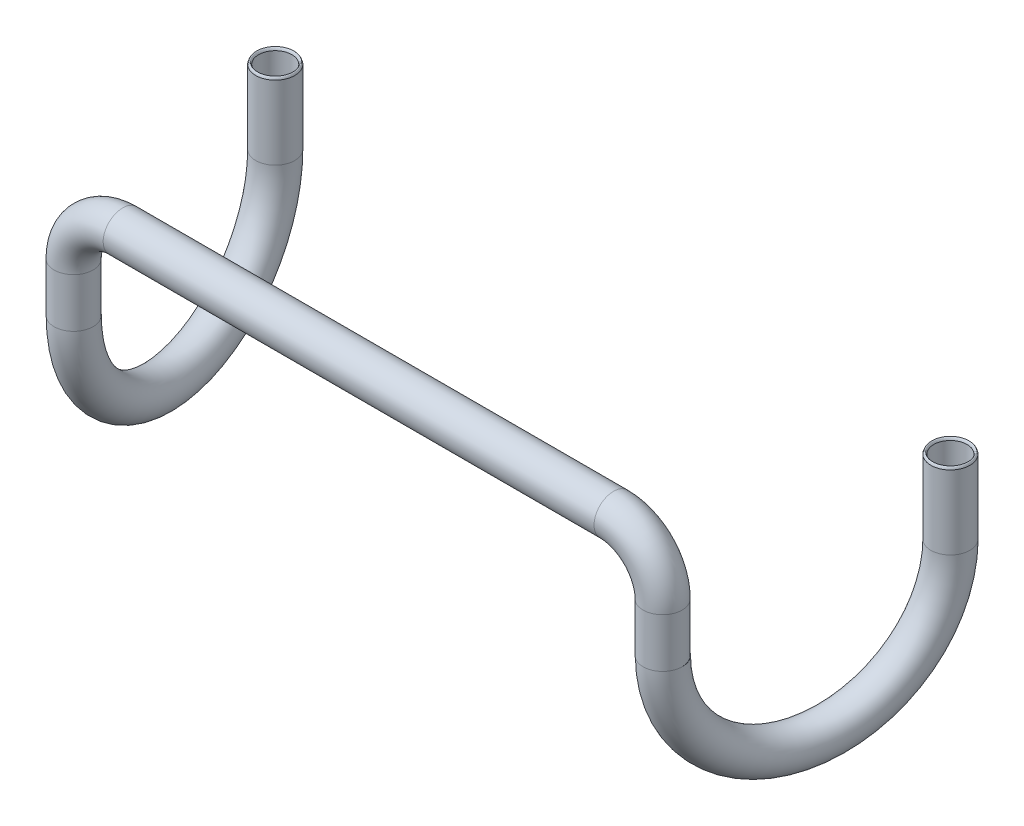
ISO-10303-21;
HEADER;
FILE_DESCRIPTION(('STEP AP214'),'2;1');
FILE_NAME('part.step','',(''),(''),'','','');
FILE_SCHEMA(('AUTOMOTIVE_DESIGN { 1 0 10303 214 1 1 1 1 }'));
ENDSEC;
DATA;
#1=APPLICATION_CONTEXT('core data for automotive mechanical design processes');
#2=APPLICATION_PROTOCOL_DEFINITION('international standard','automotive_design',2000,#1);
#3=PRODUCT_CONTEXT('',#1,'mechanical');
#4=PRODUCT('Part','Part','',(#3));
#5=PRODUCT_RELATED_PRODUCT_CATEGORY('part','',(#4));
#6=PRODUCT_DEFINITION_FORMATION('','',#4);
#7=PRODUCT_DEFINITION_CONTEXT('part definition',#1,'design');
#8=PRODUCT_DEFINITION('design','',#6,#7);
#9=PRODUCT_DEFINITION_SHAPE('','',#8);
#10=(LENGTH_UNIT() NAMED_UNIT(*) SI_UNIT(.MILLI.,.METRE.));
#11=(NAMED_UNIT(*) PLANE_ANGLE_UNIT() SI_UNIT($,.RADIAN.));
#12=(NAMED_UNIT(*) SI_UNIT($,.STERADIAN.) SOLID_ANGLE_UNIT());
#13=UNCERTAINTY_MEASURE_WITH_UNIT(LENGTH_MEASURE(1.E-05),#10,'distance_accuracy_value','');
#14=(GEOMETRIC_REPRESENTATION_CONTEXT(3) GLOBAL_UNCERTAINTY_ASSIGNED_CONTEXT((#13)) GLOBAL_UNIT_ASSIGNED_CONTEXT((#10,
#11,#12)) REPRESENTATION_CONTEXT('',''));
#15=CARTESIAN_POINT('',(0.,0.,0.));
#16=DIRECTION('',(0.,0.,1.));
#17=DIRECTION('',(1.,0.,0.));
#18=AXIS2_PLACEMENT_3D('',#15,#16,#17);
#19=CARTESIAN_POINT('',(240.,-80.,0.));
#20=DIRECTION('',(0.,-1.,0.));
#21=DIRECTION('',(0.,0.,-1.));
#22=AXIS2_PLACEMENT_3D('',#19,#20,#21);
#23=PLANE('',#22);
#24=CARTESIAN_POINT('',(240.035474595347,-79.9999999999999,-0.201612663195141));
#25=DIRECTION('',(0.,-1.,0.));
#26=DIRECTION('',(1.,0.,0.));
#27=AXIS2_PLACEMENT_3D('',#24,#25,#26);
#28=CIRCLE('',#27,13.57);
#29=CARTESIAN_POINT('',(253.388778334991,-80.,2.21379190681488));
#30=VERTEX_POINT('',#29);
#31=CARTESIAN_POINT('',(226.659698816823,-79.9999999999999,-2.48930196085725));
#32=VERTEX_POINT('',#31);
#33=EDGE_CURVE('E155',#30,#32,#28,.F.);
#34=ORIENTED_EDGE('',*,*,#33,.F.);
#35=CARTESIAN_POINT('',(240.,-80.,0.));
#36=DIRECTION('',(0.,-1.,0.));
#37=DIRECTION('',(0.,0.,-1.));
#38=AXIS2_PLACEMENT_3D('',#35,#36,#37);
#39=CIRCLE('',#38,13.5705659392009);
#40=EDGE_CURVE('E141',#30,#32,#39,.F.);
#41=ORIENTED_EDGE('',*,*,#40,.T.);
#42=EDGE_LOOP('',(#34,#41));
#43=FACE_BOUND('',#42,.T.);
#44=ADVANCED_FACE('F128',(#43),#23,.T.);
#45=CARTESIAN_POINT('',(240.035474595347,-79.9999999999999,-0.201612663195141));
#46=DIRECTION('',(0.,-1.,0.));
#47=DIRECTION('',(1.,0.,0.));
#48=AXIS2_PLACEMENT_3D('',#45,#46,#47);
#49=CIRCLE('',#48,15.9);
#50=CARTESIAN_POINT('',(255.676853348814,-80.,2.6544809435678));
#51=VERTEX_POINT('',#50);
#52=CARTESIAN_POINT('',(224.358621246532,-79.9999999999999,-2.85609360676085));
#53=VERTEX_POINT('',#52);
#54=EDGE_CURVE('E148',#51,#53,#49,.T.);
#55=ORIENTED_EDGE('',*,*,#54,.F.);
#56=CARTESIAN_POINT('',(240.,-80.,0.));
#57=DIRECTION('',(0.,-1.,0.));
#58=DIRECTION('',(0.,0.,-1.));
#59=AXIS2_PLACEMENT_3D('',#56,#57,#58);
#60=CIRCLE('',#59,15.9);
#61=EDGE_CURVE('E312',#51,#53,#60,.T.);
#62=ORIENTED_EDGE('',*,*,#61,.T.);
#63=EDGE_LOOP('',(#55,#62));
#64=FACE_BOUND('',#63,.T.);
#65=ADVANCED_FACE('F369',(#64),#23,.T.);
#66=CARTESIAN_POINT('',(0.,0.,0.));
#67=DIRECTION('',(1.,0.,0.));
#68=DIRECTION('',(0.,0.,-1.));
#69=AXIS2_PLACEMENT_3D('',#66,#67,#68);
#70=CYLINDRICAL_SURFACE('',#69,15.9);
#71=CARTESIAN_POINT('',(200.,0.,0.));
#72=DIRECTION('',(1.,0.,0.));
#73=DIRECTION('',(0.,0.,-1.));
#74=AXIS2_PLACEMENT_3D('',#71,#72,#73);
#75=CIRCLE('',#74,15.9);
#76=CARTESIAN_POINT('',(200.,15.9,0.));
#77=VERTEX_POINT('',#76);
#78=EDGE_CURVE('E317',#77,#77,#75,.T.);
#79=ORIENTED_EDGE('',*,*,#78,.F.);
#80=EDGE_LOOP('',(#79));
#81=FACE_BOUND('',#80,.T.);
#82=CARTESIAN_POINT('',(-200.,0.,0.));
#83=DIRECTION('',(1.,0.,0.));
#84=DIRECTION('',(0.,0.,-1.));
#85=AXIS2_PLACEMENT_3D('',#82,#83,#84);
#86=CIRCLE('',#85,15.9);
#87=CARTESIAN_POINT('',(-200.,15.9,0.));
#88=VERTEX_POINT('',#87);
#89=EDGE_CURVE('E217',#88,#88,#86,.T.);
#90=ORIENTED_EDGE('',*,*,#89,.T.);
#91=EDGE_LOOP('',(#90));
#92=FACE_BOUND('',#91,.T.);
#93=ADVANCED_FACE('F372',(#81,#92),#70,.T.);
#94=CARTESIAN_POINT('',(200.,-40.,0.));
#95=DIRECTION('',(0.,0.,-1.));
#96=DIRECTION('',(-1.,0.,0.));
#97=AXIS2_PLACEMENT_3D('',#94,#95,#96);
#98=TOROIDAL_SURFACE('',#97,40.,15.9);
#99=CARTESIAN_POINT('',(240.,-40.,0.));
#100=DIRECTION('',(0.,-1.,0.));
#101=DIRECTION('',(0.,0.,-1.));
#102=AXIS2_PLACEMENT_3D('',#99,#100,#101);
#103=CIRCLE('',#102,15.9);
#104=CARTESIAN_POINT('',(255.9,-40.,0.));
#105=VERTEX_POINT('',#104);
#106=EDGE_CURVE('E316',#105,#105,#103,.T.);
#107=CARTESIAN_POINT('',(200.,-40.,0.));
#108=DIRECTION('',(0.,0.,-1.));
#109=DIRECTION('',(-1.,0.,0.));
#110=AXIS2_PLACEMENT_3D('',#107,#108,#109);
#111=CIRCLE('',#110,55.9);
#112=EDGE_CURVE('',#77,#105,#111,.T.);
#113=ORIENTED_EDGE('',*,*,#78,.T.);
#114=ORIENTED_EDGE('',*,*,#106,.F.);
#115=ORIENTED_EDGE('',*,*,#112,.T.);
#116=ORIENTED_EDGE('',*,*,#112,.F.);
#117=EDGE_LOOP('',(#113,#115,#114,#116));
#118=FACE_BOUND('',#117,.T.);
#119=ADVANCED_FACE('F375',(#118),#98,.T.);
#120=CARTESIAN_POINT('',(240.,-40.,0.));
#121=DIRECTION('',(0.,-1.,0.));
#122=DIRECTION('',(1.,0.,0.));
#123=AXIS2_PLACEMENT_3D('',#120,#121,#122);
#124=CYLINDRICAL_SURFACE('',#123,15.9);
#125=ORIENTED_EDGE('',*,*,#61,.F.);
#126=EDGE_CURVE('E302',#53,#51,#60,.T.);
#127=ORIENTED_EDGE('',*,*,#126,.F.);
#128=EDGE_LOOP('',(#125,#127));
#129=FACE_BOUND('',#128,.T.);
#130=ORIENTED_EDGE('',*,*,#106,.T.);
#131=EDGE_LOOP('',(#130));
#132=FACE_BOUND('',#131,.T.);
#133=ADVANCED_FACE('F360',(#129,#132),#124,.T.);
#134=CARTESIAN_POINT('',(0.,0.,0.));
#135=DIRECTION('',(1.,0.,0.));
#136=DIRECTION('',(0.,0.,-1.));
#137=AXIS2_PLACEMENT_3D('',#134,#135,#136);
#138=CYLINDRICAL_SURFACE('',#137,13.5705659392009);
#139=CARTESIAN_POINT('',(200.,0.,0.));
#140=DIRECTION('',(1.,0.,0.));
#141=DIRECTION('',(0.,0.,-1.));
#142=AXIS2_PLACEMENT_3D('',#139,#140,#141);
#143=CIRCLE('',#142,13.5705659392009);
#144=CARTESIAN_POINT('',(200.,13.5705659392009,0.));
#145=VERTEX_POINT('',#144);
#146=EDGE_CURVE('E308',#145,#145,#143,.F.);
#147=ORIENTED_EDGE('',*,*,#146,.F.);
#148=EDGE_LOOP('',(#147));
#149=FACE_BOUND('',#148,.T.);
#150=CARTESIAN_POINT('',(-200.,0.,0.));
#151=DIRECTION('',(1.,0.,0.));
#152=DIRECTION('',(0.,0.,-1.));
#153=AXIS2_PLACEMENT_3D('',#150,#151,#152);
#154=CIRCLE('',#153,13.5705659392009);
#155=CARTESIAN_POINT('',(-200.,13.5705659392009,0.));
#156=VERTEX_POINT('',#155);
#157=EDGE_CURVE('E208',#156,#156,#154,.F.);
#158=ORIENTED_EDGE('',*,*,#157,.T.);
#159=EDGE_LOOP('',(#158));
#160=FACE_BOUND('',#159,.T.);
#161=ADVANCED_FACE('F356',(#149,#160),#138,.F.);
#162=CARTESIAN_POINT('',(200.,-40.,0.));
#163=DIRECTION('',(0.,0.,-1.));
#164=DIRECTION('',(-1.,0.,0.));
#165=AXIS2_PLACEMENT_3D('',#162,#163,#164);
#166=TOROIDAL_SURFACE('',#165,40.,13.5705659392009);
#167=CARTESIAN_POINT('',(240.,-40.,0.));
#168=DIRECTION('',(0.,-1.,0.));
#169=DIRECTION('',(0.,0.,-1.));
#170=AXIS2_PLACEMENT_3D('',#167,#168,#169);
#171=CIRCLE('',#170,13.5705659392009);
#172=CARTESIAN_POINT('',(253.570565939201,-40.,0.));
#173=VERTEX_POINT('',#172);
#174=EDGE_CURVE('E311',#173,#173,#171,.F.);
#175=CARTESIAN_POINT('',(200.,-40.,0.));
#176=DIRECTION('',(0.,0.,-1.));
#177=DIRECTION('',(-1.,0.,0.));
#178=AXIS2_PLACEMENT_3D('',#175,#176,#177);
#179=CIRCLE('',#178,53.5705659392009);
#180=EDGE_CURVE('',#145,#173,#179,.T.);
#181=ORIENTED_EDGE('',*,*,#146,.T.);
#182=ORIENTED_EDGE('',*,*,#174,.F.);
#183=ORIENTED_EDGE('',*,*,#180,.T.);
#184=ORIENTED_EDGE('',*,*,#180,.F.);
#185=EDGE_LOOP('',(#181,#183,#182,#184));
#186=FACE_BOUND('',#185,.T.);
#187=ADVANCED_FACE('F359',(#186),#166,.F.);
#188=CARTESIAN_POINT('',(240.,-40.,0.));
#189=DIRECTION('',(0.,-1.,0.));
#190=DIRECTION('',(1.,0.,0.));
#191=AXIS2_PLACEMENT_3D('',#188,#189,#190);
#192=CYLINDRICAL_SURFACE('',#191,13.5705659392009);
#193=EDGE_CURVE('E13',#32,#30,#39,.F.);
#194=ORIENTED_EDGE('',*,*,#193,.F.);
#195=ORIENTED_EDGE('',*,*,#40,.F.);
#196=EDGE_LOOP('',(#194,#195));
#197=FACE_BOUND('',#196,.T.);
#198=ORIENTED_EDGE('',*,*,#174,.T.);
#199=EDGE_LOOP('',(#198));
#200=FACE_BOUND('',#199,.T.);
#201=ADVANCED_FACE('F364',(#197,#200),#192,.F.);
#202=CARTESIAN_POINT('',(240.035474595347,-79.9999999999999,-0.201612663195141));
#203=DIRECTION('',(0.,-1.,0.));
#204=DIRECTION('',(1.,0.,0.));
#205=AXIS2_PLACEMENT_3D('',#202,#203,#204);
#206=PLANE('',#205);
#207=EDGE_CURVE('E291',#32,#30,#28,.F.);
#208=ORIENTED_EDGE('',*,*,#207,.F.);
#209=ORIENTED_EDGE('',*,*,#193,.T.);
#210=EDGE_LOOP('',(#208,#209));
#211=FACE_BOUND('',#210,.T.);
#212=ADVANCED_FACE('F348',(#211),#206,.F.);
#213=CARTESIAN_POINT('',(257.561421105602,-80.,-99.8067728164823));
#214=DIRECTION('',(0.984870472996578,0.,0.173292098548945));
#215=DIRECTION('',(0.173292098548945,0.,-0.984870472996578));
#216=AXIS2_PLACEMENT_3D('',#213,#214,#215);
#217=TOROIDAL_SURFACE('',#216,101.135289242886,15.9);
#218=CARTESIAN_POINT('',(275.087367615856,-80.0000000000001,-199.411932969769));
#219=DIRECTION('',(0.,1.,0.));
#220=DIRECTION('',(0.939939697161005,0.,0.341340542128938));
#221=AXIS2_PLACEMENT_3D('',#218,#219,#220);
#222=CIRCLE('',#221,15.9);
#223=CARTESIAN_POINT('',(290.032408800716,-80.0000000000001,-193.984618349919));
#224=VERTEX_POINT('',#223);
#225=EDGE_CURVE('E303',#224,#224,#222,.T.);
#226=ORIENTED_EDGE('',*,*,#225,.F.);
#227=EDGE_LOOP('',(#226));
#228=FACE_BOUND('',#227,.T.);
#229=ORIENTED_EDGE('',*,*,#54,.T.);
#230=EDGE_CURVE('E307',#53,#51,#49,.T.);
#231=ORIENTED_EDGE('',*,*,#230,.T.);
#232=EDGE_LOOP('',(#229,#231));
#233=FACE_BOUND('',#232,.T.);
#234=ADVANCED_FACE('F351',(#228,#233),#217,.T.);
#235=ORIENTED_EDGE('',*,*,#230,.F.);
#236=ORIENTED_EDGE('',*,*,#126,.T.);
#237=EDGE_LOOP('',(#235,#236));
#238=FACE_BOUND('',#237,.T.);
#239=ADVANCED_FACE('F346',(#238),#206,.F.);
#240=CARTESIAN_POINT('',(257.561421105602,-80.,-99.8067728164823));
#241=DIRECTION('',(0.984870472996578,0.,0.173292098548945));
#242=DIRECTION('',(0.173292098548945,0.,-0.984870472996578));
#243=AXIS2_PLACEMENT_3D('',#240,#241,#242);
#244=TOROIDAL_SURFACE('',#243,101.135289242886,13.57);
#245=CARTESIAN_POINT('',(275.087367615856,-80.0000000000001,-199.411932969769));
#246=DIRECTION('',(0.,1.,0.));
#247=DIRECTION('',(0.939939697161005,0.,0.341340542128938));
#248=AXIS2_PLACEMENT_3D('',#245,#246,#247);
#249=CIRCLE('',#248,13.57);
#250=CARTESIAN_POINT('',(287.842349306331,-80.0000000000001,-194.77994181308));
#251=VERTEX_POINT('',#250);
#252=EDGE_CURVE('E299',#251,#251,#249,.F.);
#253=ORIENTED_EDGE('',*,*,#252,.F.);
#254=EDGE_LOOP('',(#253));
#255=FACE_BOUND('',#254,.T.);
#256=ORIENTED_EDGE('',*,*,#207,.T.);
#257=ORIENTED_EDGE('',*,*,#33,.T.);
#258=EDGE_LOOP('',(#256,#257));
#259=FACE_BOUND('',#258,.T.);
#260=ADVANCED_FACE('F343',(#255,#259),#244,.F.);
#261=CARTESIAN_POINT('',(275.087367615856,-80.0000000000001,-199.411932969769));
#262=DIRECTION('',(0.,1.,0.));
#263=DIRECTION('',(0.,0.,1.));
#264=AXIS2_PLACEMENT_3D('',#261,#262,#263);
#265=CYLINDRICAL_SURFACE('',#264,15.9);
#266=CARTESIAN_POINT('',(275.087367615856,-20.,-199.411932969769));
#267=DIRECTION('',(0.,1.,0.));
#268=DIRECTION('',(-1.,0.,0.));
#269=AXIS2_PLACEMENT_3D('',#266,#267,#268);
#270=CIRCLE('',#269,15.9);
#271=CARTESIAN_POINT('',(259.187367615856,-20.,-199.411932969769));
#272=VERTEX_POINT('',#271);
#273=EDGE_CURVE('E189',#272,#272,#270,.T.);
#274=ORIENTED_EDGE('',*,*,#273,.F.);
#275=EDGE_LOOP('',(#274));
#276=FACE_BOUND('',#275,.T.);
#277=ORIENTED_EDGE('',*,*,#225,.T.);
#278=EDGE_LOOP('',(#277));
#279=FACE_BOUND('',#278,.T.);
#280=ADVANCED_FACE('F334',(#276,#279),#265,.T.);
#281=CARTESIAN_POINT('',(275.087367615856,-80.0000000000001,-199.411932969769));
#282=DIRECTION('',(0.,1.,0.));
#283=DIRECTION('',(0.,0.,1.));
#284=AXIS2_PLACEMENT_3D('',#281,#282,#283);
#285=CYLINDRICAL_SURFACE('',#284,13.57);
#286=CARTESIAN_POINT('',(275.087367615856,-20.,-199.411932969769));
#287=DIRECTION('',(0.,1.,0.));
#288=DIRECTION('',(-1.,0.,0.));
#289=AXIS2_PLACEMENT_3D('',#286,#287,#288);
#290=CIRCLE('',#289,13.57);
#291=CARTESIAN_POINT('',(261.517367615856,-20.,-199.411932969769));
#292=VERTEX_POINT('',#291);
#293=EDGE_CURVE('E322',#292,#292,#290,.F.);
#294=ORIENTED_EDGE('',*,*,#293,.F.);
#295=EDGE_LOOP('',(#294));
#296=FACE_BOUND('',#295,.T.);
#297=ORIENTED_EDGE('',*,*,#252,.T.);
#298=EDGE_LOOP('',(#297));
#299=FACE_BOUND('',#298,.T.);
#300=ADVANCED_FACE('F281',(#296,#299),#285,.F.);
#301=CARTESIAN_POINT('',(275.095647339464,-190.538331539801,-176.236169129557));
#302=CARTESIAN_POINT('',(270.45883862379,42.3046122833005,-180.872977845232));
#303=CARTESIAN_POINT('',(265.822029908117,-37.6608264869324,-185.509786560908));
#304=CARTESIAN_POINT('',(261.185221192443,-37.6609984806695,-190.146595276584));
#305=CARTESIAN_POINT('',(256.54841247677,42.3047998183723,-194.78340399226));
#306=CARTESIAN_POINT('',(251.911603761096,-190.53855846105,-199.420212707935));
#307=CARTESIAN_POINT('',(279.73649091204,42.3407917328004,-180.877012702131));
#308=CARTESIAN_POINT('',(275.099682196368,118.050039882033,-185.513821417807));
#309=CARTESIAN_POINT('',(270.462873480693,-40.4829067816589,-190.150630133483));
#310=CARTESIAN_POINT('',(265.826064765021,-40.4830357840587,-194.787438849159));
#311=CARTESIAN_POINT('',(261.189256049346,118.050111680971,-199.424247564834));
#312=CARTESIAN_POINT('',(256.552447333673,42.3409433693256,-204.06105628051));
#313=CARTESIAN_POINT('',(284.377334484618,-37.8522342839571,-185.517856274706));
#314=CARTESIAN_POINT('',(279.740525768943,-40.5859575808756,-190.154664990382));
#315=CARTESIAN_POINT('',(275.103717053272,-238.340160502466,-194.791473706058));
#316=CARTESIAN_POINT('',(270.466908337596,-238.340274995985,-199.428282421733));
#317=CARTESIAN_POINT('',(265.830099621924,-40.5860342664694,-204.065091137409));
#318=CARTESIAN_POINT('',(261.19329090625,-37.8523506278419,-208.701899853084));
#319=CARTESIAN_POINT('',(289.018178057193,-37.5986280447977,-190.15869984728));
#320=CARTESIAN_POINT('',(284.381369341522,-40.0830436532029,-194.795508562956));
#321=CARTESIAN_POINT('',(279.744560625845,-237.712605766736,-199.432317278632));
#322=CARTESIAN_POINT('',(275.107751910175,-237.712642159808,-204.069125994308));
#323=CARTESIAN_POINT('',(270.470943194499,-40.082977212654,-208.705934709983));
#324=CARTESIAN_POINT('',(265.834134478827,-37.5985338685168,-213.342743425659));
#325=CARTESIAN_POINT('',(293.659021629772,42.4780935828116,-194.799543419855));
#326=CARTESIAN_POINT('',(289.022212914096,118.934620448465,-199.436352135531));
#327=CARTESIAN_POINT('',(284.385404198425,-39.2245989975511,-204.073160851206));
#328=CARTESIAN_POINT('',(279.748595482749,-39.2245839417998,-208.709969566882));
#329=CARTESIAN_POINT('',(275.111786767078,118.934626779491,-213.346778282558));
#330=CARTESIAN_POINT('',(270.474978051403,42.4780132214629,-217.983586998234));
#331=CARTESIAN_POINT('',(298.299865202347,-192.389586436148,-199.44038699243));
#332=CARTESIAN_POINT('',(293.663056486675,41.6992773666061,-204.077195708105));
#333=CARTESIAN_POINT('',(289.026247770999,-37.6434938655722,-208.714004423781));
#334=CARTESIAN_POINT('',(284.389439055328,-37.6434561659727,-213.350813139457));
#335=CARTESIAN_POINT('',(279.752630339653,41.6992335285328,-217.987621855133));
#336=CARTESIAN_POINT('',(275.11582162398,-192.38952854488,-222.624430570808));
#337=B_SPLINE_SURFACE_WITH_KNOTS('',5,5,((#301,#302,#303,#304,#305,#306),(#307,#308,#309,#310,
#311,#312),(#313,#314,#315,#316,#317,#318),(#319,#320,#321,#322,#323,#324),(#325,#326,#327,#328,
#329,#330),(#331,#332,#333,#334,#335,#336)),.UNSPECIFIED.,.F.,.F.,.F.,(6,6),(6,6),
(-12.5986048977107,20.2171147082318),(-16.3935944193053,16.3935944398789),.UNSPECIFIED.);
#338=ORIENTED_EDGE('',*,*,#293,.T.);
#339=EDGE_LOOP('',(#338));
#340=FACE_BOUND('',#339,.T.);
#341=ORIENTED_EDGE('',*,*,#273,.T.);
#342=EDGE_LOOP('',(#341));
#343=FACE_BOUND('',#342,.T.);
#344=ADVANCED_FACE('F130',(#340,#343),#337,.T.);
#345=CARTESIAN_POINT('',(-240.,-80.,0.));
#346=DIRECTION('',(0.,-1.,0.));
#347=DIRECTION('',(0.,0.,-1.));
#348=AXIS2_PLACEMENT_3D('',#345,#346,#347);
#349=PLANE('',#348);
#350=CARTESIAN_POINT('',(-240.035474595347,-79.9999999999999,-0.201612663195141));
#351=DIRECTION('',(0.,1.,0.));
#352=DIRECTION('',(-1.,0.,0.));
#353=AXIS2_PLACEMENT_3D('',#350,#351,#352);
#354=CIRCLE('',#353,13.57);
#355=CARTESIAN_POINT('',(-253.388778334991,-80.,2.21379190681488));
#356=VERTEX_POINT('',#355);
#357=CARTESIAN_POINT('',(-226.659698816823,-79.9999999999999,-2.48930196085725));
#358=VERTEX_POINT('',#357);
#359=EDGE_CURVE('E179',#356,#358,#354,.F.);
#360=ORIENTED_EDGE('',*,*,#359,.T.);
#361=CARTESIAN_POINT('',(-240.,-80.,0.));
#362=DIRECTION('',(0.,1.,0.));
#363=DIRECTION('',(0.,0.,-1.));
#364=AXIS2_PLACEMENT_3D('',#361,#362,#363);
#365=CIRCLE('',#364,13.5705659392009);
#366=EDGE_CURVE('E190',#356,#358,#365,.F.);
#367=ORIENTED_EDGE('',*,*,#366,.F.);
#368=EDGE_LOOP('',(#360,#367));
#369=FACE_BOUND('',#368,.T.);
#370=ADVANCED_FACE('F196',(#369),#349,.T.);
#371=CARTESIAN_POINT('',(-240.035474595347,-79.9999999999999,-0.201612663195141));
#372=DIRECTION('',(0.,1.,0.));
#373=DIRECTION('',(-1.,0.,0.));
#374=AXIS2_PLACEMENT_3D('',#371,#372,#373);
#375=CIRCLE('',#374,15.9);
#376=CARTESIAN_POINT('',(-255.676853348814,-80.,2.6544809435678));
#377=VERTEX_POINT('',#376);
#378=CARTESIAN_POINT('',(-224.358621246532,-79.9999999999999,-2.85609360676085));
#379=VERTEX_POINT('',#378);
#380=EDGE_CURVE('E199',#377,#379,#375,.T.);
#381=ORIENTED_EDGE('',*,*,#380,.T.);
#382=CARTESIAN_POINT('',(-240.,-80.,0.));
#383=DIRECTION('',(0.,1.,0.));
#384=DIRECTION('',(0.,0.,-1.));
#385=AXIS2_PLACEMENT_3D('',#382,#383,#384);
#386=CIRCLE('',#385,15.9);
#387=EDGE_CURVE('E211',#377,#379,#386,.T.);
#388=ORIENTED_EDGE('',*,*,#387,.F.);
#389=EDGE_LOOP('',(#381,#388));
#390=FACE_BOUND('',#389,.T.);
#391=ADVANCED_FACE('F266',(#390),#349,.T.);
#392=CARTESIAN_POINT('',(-200.,-40.,0.));
#393=DIRECTION('',(0.,0.,-1.));
#394=DIRECTION('',(1.,0.,0.));
#395=AXIS2_PLACEMENT_3D('',#392,#393,#394);
#396=TOROIDAL_SURFACE('',#395,40.,15.9);
#397=CARTESIAN_POINT('',(-240.,-40.,0.));
#398=DIRECTION('',(0.,1.,0.));
#399=DIRECTION('',(0.,0.,-1.));
#400=AXIS2_PLACEMENT_3D('',#397,#398,#399);
#401=CIRCLE('',#400,15.9);
#402=CARTESIAN_POINT('',(-255.9,-40.,0.));
#403=VERTEX_POINT('',#402);
#404=EDGE_CURVE('E216',#403,#403,#401,.T.);
#405=CARTESIAN_POINT('',(-200.,-40.,0.));
#406=DIRECTION('',(0.,0.,-1.));
#407=DIRECTION('',(1.,0.,0.));
#408=AXIS2_PLACEMENT_3D('',#405,#406,#407);
#409=CIRCLE('',#408,55.9);
#410=EDGE_CURVE('',#403,#88,#409,.T.);
#411=ORIENTED_EDGE('',*,*,#404,.T.);
#412=ORIENTED_EDGE('',*,*,#89,.F.);
#413=ORIENTED_EDGE('',*,*,#410,.T.);
#414=ORIENTED_EDGE('',*,*,#410,.F.);
#415=EDGE_LOOP('',(#411,#413,#412,#414));
#416=FACE_BOUND('',#415,.T.);
#417=ADVANCED_FACE('F267',(#416),#396,.T.);
#418=CARTESIAN_POINT('',(-240.,-40.,0.));
#419=DIRECTION('',(0.,-1.,0.));
#420=DIRECTION('',(-1.,0.,0.));
#421=AXIS2_PLACEMENT_3D('',#418,#419,#420);
#422=CYLINDRICAL_SURFACE('',#421,15.9);
#423=ORIENTED_EDGE('',*,*,#387,.T.);
#424=EDGE_CURVE('E203',#379,#377,#386,.T.);
#425=ORIENTED_EDGE('',*,*,#424,.T.);
#426=EDGE_LOOP('',(#423,#425));
#427=FACE_BOUND('',#426,.T.);
#428=ORIENTED_EDGE('',*,*,#404,.F.);
#429=EDGE_LOOP('',(#428));
#430=FACE_BOUND('',#429,.T.);
#431=ADVANCED_FACE('F260',(#427,#430),#422,.T.);
#432=CARTESIAN_POINT('',(-200.,-40.,0.));
#433=DIRECTION('',(0.,0.,-1.));
#434=DIRECTION('',(1.,0.,0.));
#435=AXIS2_PLACEMENT_3D('',#432,#433,#434);
#436=TOROIDAL_SURFACE('',#435,40.,13.5705659392009);
#437=CARTESIAN_POINT('',(-240.,-40.,0.));
#438=DIRECTION('',(0.,1.,0.));
#439=DIRECTION('',(0.,0.,-1.));
#440=AXIS2_PLACEMENT_3D('',#437,#438,#439);
#441=CIRCLE('',#440,13.5705659392009);
#442=CARTESIAN_POINT('',(-253.570565939201,-40.,0.));
#443=VERTEX_POINT('',#442);
#444=EDGE_CURVE('E195',#443,#443,#441,.F.);
#445=CARTESIAN_POINT('',(-200.,-40.,0.));
#446=DIRECTION('',(0.,0.,-1.));
#447=DIRECTION('',(1.,0.,0.));
#448=AXIS2_PLACEMENT_3D('',#445,#446,#447);
#449=CIRCLE('',#448,53.5705659392009);
#450=EDGE_CURVE('',#443,#156,#449,.T.);
#451=ORIENTED_EDGE('',*,*,#444,.T.);
#452=ORIENTED_EDGE('',*,*,#157,.F.);
#453=ORIENTED_EDGE('',*,*,#450,.T.);
#454=ORIENTED_EDGE('',*,*,#450,.F.);
#455=EDGE_LOOP('',(#451,#453,#452,#454));
#456=FACE_BOUND('',#455,.T.);
#457=ADVANCED_FACE('F257',(#456),#436,.F.);
#458=CARTESIAN_POINT('',(-240.,-40.,0.));
#459=DIRECTION('',(0.,-1.,0.));
#460=DIRECTION('',(-1.,0.,0.));
#461=AXIS2_PLACEMENT_3D('',#458,#459,#460);
#462=CYLINDRICAL_SURFACE('',#461,13.5705659392009);
#463=EDGE_CURVE('E184',#358,#356,#365,.F.);
#464=ORIENTED_EDGE('',*,*,#463,.T.);
#465=ORIENTED_EDGE('',*,*,#366,.T.);
#466=EDGE_LOOP('',(#464,#465));
#467=FACE_BOUND('',#466,.T.);
#468=ORIENTED_EDGE('',*,*,#444,.F.);
#469=EDGE_LOOP('',(#468));
#470=FACE_BOUND('',#469,.T.);
#471=ADVANCED_FACE('F192',(#467,#470),#462,.F.);
#472=CARTESIAN_POINT('',(-240.035474595347,-79.9999999999999,-0.201612663195141));
#473=DIRECTION('',(0.,-1.,0.));
#474=DIRECTION('',(-1.,0.,0.));
#475=AXIS2_PLACEMENT_3D('',#472,#473,#474);
#476=PLANE('',#475);
#477=EDGE_CURVE('E175',#358,#356,#354,.F.);
#478=ORIENTED_EDGE('',*,*,#477,.T.);
#479=ORIENTED_EDGE('',*,*,#463,.F.);
#480=EDGE_LOOP('',(#478,#479));
#481=FACE_BOUND('',#480,.T.);
#482=ADVANCED_FACE('F186',(#481),#476,.F.);
#483=CARTESIAN_POINT('',(-257.561421105602,-80.,-99.8067728164823));
#484=DIRECTION('',(-0.984870472996578,0.,0.173292098548945));
#485=DIRECTION('',(-0.173292098548945,0.,-0.984870472996578));
#486=AXIS2_PLACEMENT_3D('',#483,#484,#485);
#487=TOROIDAL_SURFACE('',#486,101.135289242886,15.9);
#488=CARTESIAN_POINT('',(-275.087367615856,-80.0000000000001,-199.411932969769));
#489=DIRECTION('',(0.,-1.,0.));
#490=DIRECTION('',(-0.939939697161005,0.,0.341340542128938));
#491=AXIS2_PLACEMENT_3D('',#488,#489,#490);
#492=CIRCLE('',#491,15.9);
#493=CARTESIAN_POINT('',(-290.032408800716,-80.0000000000001,-193.984618349919));
#494=VERTEX_POINT('',#493);
#495=EDGE_CURVE('E197',#494,#494,#492,.T.);
#496=ORIENTED_EDGE('',*,*,#495,.T.);
#497=EDGE_LOOP('',(#496));
#498=FACE_BOUND('',#497,.T.);
#499=ORIENTED_EDGE('',*,*,#380,.F.);
#500=EDGE_CURVE('E207',#379,#377,#375,.T.);
#501=ORIENTED_EDGE('',*,*,#500,.F.);
#502=EDGE_LOOP('',(#499,#501));
#503=FACE_BOUND('',#502,.T.);
#504=ADVANCED_FACE('F252',(#498,#503),#487,.T.);
#505=ORIENTED_EDGE('',*,*,#500,.T.);
#506=ORIENTED_EDGE('',*,*,#424,.F.);
#507=EDGE_LOOP('',(#505,#506));
#508=FACE_BOUND('',#507,.T.);
#509=ADVANCED_FACE('F248',(#508),#476,.F.);
#510=CARTESIAN_POINT('',(-257.561421105602,-80.,-99.8067728164823));
#511=DIRECTION('',(-0.984870472996578,0.,0.173292098548945));
#512=DIRECTION('',(-0.173292098548945,0.,-0.984870472996578));
#513=AXIS2_PLACEMENT_3D('',#510,#511,#512);
#514=TOROIDAL_SURFACE('',#513,101.135289242886,13.57);
#515=CARTESIAN_POINT('',(-275.087367615856,-80.0000000000001,-199.411932969769));
#516=DIRECTION('',(0.,-1.,0.));
#517=DIRECTION('',(-0.939939697161005,0.,0.341340542128938));
#518=AXIS2_PLACEMENT_3D('',#515,#516,#517);
#519=CIRCLE('',#518,13.57);
#520=CARTESIAN_POINT('',(-287.842349306331,-80.0000000000001,-194.77994181308));
#521=VERTEX_POINT('',#520);
#522=EDGE_CURVE('E182',#521,#521,#519,.F.);
#523=ORIENTED_EDGE('',*,*,#522,.T.);
#524=EDGE_LOOP('',(#523));
#525=FACE_BOUND('',#524,.T.);
#526=ORIENTED_EDGE('',*,*,#477,.F.);
#527=ORIENTED_EDGE('',*,*,#359,.F.);
#528=EDGE_LOOP('',(#526,#527));
#529=FACE_BOUND('',#528,.T.);
#530=ADVANCED_FACE('F177',(#525,#529),#514,.F.);
#531=CARTESIAN_POINT('',(-275.087367615856,-80.0000000000001,-199.411932969769));
#532=DIRECTION('',(0.,1.,0.));
#533=DIRECTION('',(0.,0.,1.));
#534=AXIS2_PLACEMENT_3D('',#531,#532,#533);
#535=CYLINDRICAL_SURFACE('',#534,15.9);
#536=CARTESIAN_POINT('',(-259.187369027777,-20.0000003804961,-199.411932969769));
#537=CARTESIAN_POINT('',(-259.1873462931,-20.0000645132427,-199.672101743223));
#538=CARTESIAN_POINT('',(-259.193737707829,-20.0000625413065,-199.932268600435));
#539=CARTESIAN_POINT('',(-259.219281430411,-20.0000285110753,-200.451967065311));
#540=CARTESIAN_POINT('',(-259.238433329952,-19.9999964537431,-200.711498693033));
#541=CARTESIAN_POINT('',(-259.289431846777,-20.0000043669511,-201.229324430399));
#542=CARTESIAN_POINT('',(-259.321279072987,-20.0000443409466,-201.48761848008));
#543=CARTESIAN_POINT('',(-259.397628390599,-20.0000422420563,-202.002312406652));
#544=CARTESIAN_POINT('',(-259.442129671958,-20.0000001744213,-202.258712403711));
#545=CARTESIAN_POINT('',(-259.543640293742,-20.000000760549,-202.7690414285));
#546=CARTESIAN_POINT('',(-259.600650434471,-20.0000434197337,-203.022970297043));
#547=CARTESIAN_POINT('',(-259.72708021493,-20.0000432846373,-203.527702394819));
#548=CARTESIAN_POINT('',(-259.796499060045,-20.0000004958262,-203.778505823097));
#549=CARTESIAN_POINT('',(-259.947542044385,-20.0000005496223,-204.276427671369));
#550=CARTESIAN_POINT('',(-260.029166965022,-20.0000433977141,-204.523545854326));
#551=CARTESIAN_POINT('',(-260.20446026186,-20.0000433939594,-205.013455258593));
#552=CARTESIAN_POINT('',(-260.298127865874,-20.0000005476053,-205.256246756199));
#553=CARTESIAN_POINT('',(-260.497248384084,-20.000000551149,-205.736966187696));
#554=CARTESIAN_POINT('',(-260.602702053767,-20.0000434065433,-205.974893808656));
#555=CARTESIAN_POINT('',(-260.825170738257,-20.0000434001904,-206.445262437128));
#556=CARTESIAN_POINT('',(-260.942185010619,-20.0000005439444,-206.677703795793));
#557=CARTESIAN_POINT('',(-261.187465414969,-20.0000005331074,-207.136591224673));
#558=CARTESIAN_POINT('',(-261.315732269041,-20.0000433840201,-207.363036908924));
#559=CARTESIAN_POINT('',(-261.583233869129,-20.0000433701031,-207.80933485787));
#560=CARTESIAN_POINT('',(-261.722467910088,-20.000000510779,-208.02918754516));
#561=CARTESIAN_POINT('',(-262.011546040168,-20.0000004954867,-208.461823625997));
#562=CARTESIAN_POINT('',(-262.161390810317,-20.0000433450242,-208.674606564496));
#563=CARTESIAN_POINT('',(-262.471349169967,-20.0000433316904,-209.092535727424));
#564=CARTESIAN_POINT('',(-262.63146209937,-20.0000004743235,-209.297682441418));
#565=CARTESIAN_POINT('',(-262.961554002435,-20.0000004642458,-209.699900634871));
#566=CARTESIAN_POINT('',(-263.131533608791,-20.0000433170369,-209.896971595092));
#567=CARTESIAN_POINT('',(-263.480963680003,-20.0000433120426,-210.282507064506));
#568=CARTESIAN_POINT('',(-263.660413536607,-20.0000004597552,-210.470972124987));
#569=CARTESIAN_POINT('',(-264.028340260643,-20.0000004602089,-210.838898835789));
#570=CARTESIAN_POINT('',(-264.216817706051,-20.0000433184446,-211.018359908133));
#571=CARTESIAN_POINT('',(-264.602354284957,-20.000043323837,-211.367788754057));
#572=CARTESIAN_POINT('',(-264.799412867905,-20.0000004764847,-211.537757135077));
#573=CARTESIAN_POINT('',(-265.201631070686,-20.000000485921,-211.867849029265));
#574=CARTESIAN_POINT('',(-265.406791208465,-20.0000433481981,-212.027971911315));
#575=CARTESIAN_POINT('',(-265.824721348346,-20.0000433590074,-212.337928950725));
#576=CARTESIAN_POINT('',(-266.037490862474,-20.0000005130264,-212.487763766045));
#577=CARTESIAN_POINT('',(-266.470126944704,-20.0000005238365,-212.776841898498));
#578=CARTESIAN_POINT('',(-266.689993966276,-20.0000433861143,-212.916084536964));
#579=CARTESIAN_POINT('',(-267.136292750915,-20.0000433935075,-213.18358473991));
#580=CARTESIAN_POINT('',(-267.362724092732,-20.0000005441112,-213.311843007207));
#581=CARTESIAN_POINT('',(-267.821611516599,-20.0000005469965,-213.557123425237));
#582=CARTESIAN_POINT('',(-268.054067983726,-20.0000434047692,-213.674144855541));
#583=CARTESIAN_POINT('',(-268.524437304418,-20.0000434013652,-213.896612076344));
#584=CARTESIAN_POINT('',(-268.762349807233,-20.0000005456834,-214.002058608444));
#585=CARTESIAN_POINT('',(-269.243069232347,-20.0000005358036,-214.201179145044));
#586=CARTESIAN_POINT('',(-269.485876467699,-20.0000433871044,-214.294852393768));
#587=CARTESIAN_POINT('',(-269.975786420038,-20.0000433715112,-214.470144161213));
#588=CARTESIAN_POINT('',(-270.22288886027,-20.0000005101198,-214.551763453421));
#589=CARTESIAN_POINT('',(-270.720810704372,-20.0000004898204,-214.70280646294));
#590=CARTESIAN_POINT('',(-270.971630345996,-20.000043336418,-214.77222939648));
#591=CARTESIAN_POINT('',(-271.476362846258,-20.0000433144372,-214.898657537884));
#592=CARTESIAN_POINT('',(-271.730275505123,-20.0000004513657,-214.955663543289));
#593=CARTESIAN_POINT('',(-272.240604519497,-20.0000004291307,-215.057174369853));
#594=CARTESIAN_POINT('',(-272.497021034837,-20.0000432754745,-215.101678387487));
#595=CARTESIAN_POINT('',(-273.011715243745,-20.0000432568855,-215.178025295088));
#596=CARTESIAN_POINT('',(-273.269992816711,-20.0000003974578,-215.2098689981));
#597=CARTESIAN_POINT('',(-273.787814259271,-20.0000003840002,-215.26087000097));
#598=CARTESIAN_POINT('',(-274.047358209103,-20.0000432354731,-215.280026486182));
#599=CARTESIAN_POINT('',(-274.567057336465,-20.0000432288745,-215.305556864428));
#600=CARTESIAN_POINT('',(-274.827212473715,-20.0000003763013,-215.311931577434));
#601=CARTESIAN_POINT('',(-275.347539436502,-20.0000003771042,-215.311931566417));
#602=CARTESIAN_POINT('',(-275.60771126204,-20.0000432359751,-215.305556025003));
#603=CARTESIAN_POINT('',(-276.127410307178,-20.000043243927,-215.280023992282));
#604=CARTESIAN_POINT('',(-276.386937567006,-20.0000003984987,-215.260868319766));
#605=CARTESIAN_POINT('',(-276.904759008328,-20.000000412626,-215.209867299964));
#606=CARTESIAN_POINT('',(-277.16305310981,-20.0000432776691,-215.178021140303));
#607=CARTESIAN_POINT('',(-277.677747074646,-20.0000432951281,-215.101672603387));
#608=CARTESIAN_POINT('',(-277.934147058174,-20.0000004530294,-215.057171036268));
#609=CARTESIAN_POINT('',(-278.444476072274,-20.0000004722033,-214.955660204844));
#610=CARTESIAN_POINT('',(-278.698404943672,-20.0000433389604,-214.898650140306));
#611=CARTESIAN_POINT('',(-279.203137044319,-20.0000433561841,-214.772220414372));
#612=CARTESIAN_POINT('',(-279.453940472589,-20.0000005121367,-214.702801547502));
#613=CARTESIAN_POINT('',(-279.951862319275,-20.0000005259978,-214.551758546092));
#614=CARTESIAN_POINT('',(-280.198980500692,-20.0000433893942,-214.470133630272));
#615=CARTESIAN_POINT('',(-280.688889904658,-20.0000433972244,-214.294840335109));
#616=CARTESIAN_POINT('',(-280.931681403446,-20.0000005471504,-214.201172727798));
#617=CARTESIAN_POINT('',(-281.412400834311,-20.0000005482127,-214.002052206417));
#618=CARTESIAN_POINT('',(-281.650328453519,-20.0000434048446,-213.896598537012));
#619=CARTESIAN_POINT('',(-282.120697081829,-20.0000433995131,-213.674129852106));
#620=CARTESIAN_POINT('',(-282.353138442013,-20.0000005430499,-213.557115578903));
#621=CARTESIAN_POINT('',(-282.812025872423,-20.0000005318165,-213.311835174997));
#622=CARTESIAN_POINT('',(-283.03847155674,-20.0000433825494,-213.183568322306));
#623=CARTESIAN_POINT('',(-283.484769507856,-20.0000433676345,-212.91606672533));
#624=CARTESIAN_POINT('',(-283.704622197216,-20.0000005074921,-212.776832686041));
#625=CARTESIAN_POINT('',(-284.137258283893,-20.0000004905465,-212.487754559793));
#626=CARTESIAN_POINT('',(-284.350041226137,-20.0000433392495,-212.337909791767));
#627=CARTESIAN_POINT('',(-284.767970394886,-20.0000433235794,-212.027951438475));
#628=CARTESIAN_POINT('',(-284.973117111039,-20.0000004647117,-211.86783851342));
#629=CARTESIAN_POINT('',(-285.375335313152,-20.0000004517849,-211.537746616249));
#630=CARTESIAN_POINT('',(-285.572406279724,-20.0000433032295,-211.367767011258));
#631=CARTESIAN_POINT('',(-285.957941757055,-20.0000432955996,-211.018336946051));
#632=CARTESIAN_POINT('',(-286.146406819301,-20.0000004420252,-210.838887094306));
#633=CARTESIAN_POINT('',(-286.514333537052,-20.0000004400673,-210.470960375036));
#634=CARTESIAN_POINT('',(-286.693794614382,-20.0000432971803,-210.282482929336));
#635=CARTESIAN_POINT('',(-287.043223465509,-20.0000433012679,-209.896946351641));
#636=CARTESIAN_POINT('',(-287.213191846914,-20.0000004537348,-209.699887770348));
#637=CARTESIAN_POINT('',(-287.543283741366,-20.0000004632674,-209.297669567333));
#638=CARTESIAN_POINT('',(-287.703406623203,-20.0000433258222,-209.092509427591));
#639=CARTESIAN_POINT('',(-288.013363659543,-20.0000433381648,-208.67457928223));
#640=CARTESIAN_POINT('',(-288.163198472014,-20.0000004934392,-208.461809764593));
#641=CARTESIAN_POINT('',(-288.452276594482,-20.0000005073101,-208.029173676396));
#642=CARTESIAN_POINT('',(-288.591519225933,-20.0000433713925,-207.809306652446));
#643=CARTESIAN_POINT('',(-288.859019415505,-20.0000433832946,-207.363007858093));
#644=CARTESIAN_POINT('',(-288.987277676232,-20.0000005366011,-207.136576508812));
#645=CARTESIAN_POINT('',(-289.232558075796,-20.0000005450225,-206.677689076485));
#646=CARTESIAN_POINT('',(-289.349579494535,-20.0000434056261,-206.445232608539));
#647=CARTESIAN_POINT('',(-289.572046695974,-20.0000434080088,-205.974863279201));
#648=CARTESIAN_POINT('',(-289.677493219897,-20.0000005552803,-205.736950768381));
#649=CARTESIAN_POINT('',(-289.876613737398,-20.0000005510062,-205.256231336158));
#650=CARTESIAN_POINT('',(-289.970286975598,-20.0000434049566,-205.013424101867));
#651=CARTESIAN_POINT('',(-290.145578726968,-20.0000433938226,-204.523514146307));
#652=CARTESIAN_POINT('',(-290.227198013295,-20.0000005342385,-204.276411701675));
#653=CARTESIAN_POINT('',(-290.378241012528,-20.0000005167341,-203.778489854899));
#654=CARTESIAN_POINT('',(-290.447663941905,-20.0000433643177,-203.527670215072));
#655=CARTESIAN_POINT('',(-290.574092079508,-20.0000433431435,-203.022937717341));
#656=CARTESIAN_POINT('',(-290.63109808517,-20.0000004798919,-202.769025059183));
#657=CARTESIAN_POINT('',(-290.732608916525,-20.0000004566348,-202.258696045384));
#658=CARTESIAN_POINT('',(-290.77711293862,-20.0000433021369,-202.002279529896));
#659=CARTESIAN_POINT('',(-290.853459857494,-20.000043280296,-201.487585325623));
#660=CARTESIAN_POINT('',(-290.885303567555,-20.0000004184599,-201.229307757474));
#661=CARTESIAN_POINT('',(-290.936304588151,-20.0000003999135,-200.71148631639));
#662=CARTESIAN_POINT('',(-290.955461083648,-20.0000432487088,-200.45194236318));
#663=CARTESIAN_POINT('',(-290.980991482635,-20.0000432364363,-199.932243238092));
#664=CARTESIAN_POINT('',(-290.987366206564,-20.0000003808701,-199.672088106518));
#665=CARTESIAN_POINT('',(-290.987366217518,-20.0000003757536,-199.151761144495));
#666=CARTESIAN_POINT('',(-290.980990686661,-20.0000432317015,-198.891589314046));
#667=CARTESIAN_POINT('',(-290.955458673267,-20.0000432343143,-198.371890267143));
#668=CARTESIAN_POINT('',(-290.936303009937,-20.0000003864725,-198.112363010442));
#669=CARTESIAN_POINT('',(-290.885302005351,-20.0000003964727,-197.594541568335));
#670=CARTESIAN_POINT('',(-290.853455851382,-20.0000432598044,-197.336247462973));
#671=CARTESIAN_POINT('',(-290.777107322711,-20.0000432749183,-196.821553494637));
#672=CARTESIAN_POINT('',(-290.732605758337,-20.0000004321871,-196.56515351146));
#673=CARTESIAN_POINT('',(-290.631094928669,-20.0000004507636,-196.054824497919));
#674=CARTESIAN_POINT('',(-290.574084863102,-20.0000433175562,-195.80089562674));
#675=CARTESIAN_POINT('',(-290.447655131469,-20.0000433362376,-195.296163525026));
#676=CARTESIAN_POINT('',(-290.37823625981,-20.0000004936117,-195.045360095502));
#677=CARTESIAN_POINT('',(-290.227193247674,-20.0000005106768,-194.547438252474));
#678=CARTESIAN_POINT('',(-290.145568326164,-20.0000433758541,-194.300320075894));
#679=CARTESIAN_POINT('',(-289.970275016255,-20.0000433877762,-193.810410675759));
#680=CARTESIAN_POINT('',(-289.876607399562,-20.000000540011,-193.567619176079));
#681=CARTESIAN_POINT('',(-289.677486861698,-20.0000005459865,-193.086899750787));
#682=CARTESIAN_POINT('',(-289.57203318552,-20.0000434052206,-192.848972137907));
#683=CARTESIAN_POINT('',(-289.349564485638,-20.0000434044512,-192.378603516983));
#684=CARTESIAN_POINT('',(-289.232550203974,-20.0000005499459,-192.146162157977));
#685=CARTESIAN_POINT('',(-288.987269786661,-20.0000005424748,-191.687274733304));
#686=CARTESIAN_POINT('',(-288.859002929209,-20.0000433950105,-191.460829053446));
#687=CARTESIAN_POINT('',(-288.591501324224,-20.0000433829597,-191.014531109049));
#688=CARTESIAN_POINT('',(-288.452267281629,-20.0000005238782,-190.794678421983));
#689=CARTESIAN_POINT('',(-288.163189150889,-20.0000005083247,-190.362042338472));
#690=CARTESIAN_POINT('',(-288.01334438167,-20.000043357359,-190.149259397104));
#691=CARTESIAN_POINT('',(-287.703386029275,-20.0000433417993,-189.731330230401));
#692=CARTESIAN_POINT('',(-287.543273106396,-20.0000004827115,-189.526183515354));
#693=CARTESIAN_POINT('',(-287.213181213095,-20.0000004687315,-189.123965311403));
#694=CARTESIAN_POINT('',(-287.043201609671,-20.000043319344,-188.92689434199));
#695=CARTESIAN_POINT('',(-286.693771551152,-20.0000433096443,-188.541358861034));
#696=CARTESIAN_POINT('',(-286.514321704677,-20.0000004548338,-188.352893797868));
#697=CARTESIAN_POINT('',(-286.146394993198,-20.0000004502773,-187.984967074187));
#698=CARTESIAN_POINT('',(-285.95791754986,-20.0000433060295,-187.805505992005));
#699=CARTESIAN_POINT('',(-285.572380979642,-20.0000433073537,-187.456077133968));
#700=CARTESIAN_POINT('',(-285.375322403602,-20.0000004584193,-187.286108750352));
#701=CARTESIAN_POINT('',(-284.973104207945,-20.0000004652123,-186.956016849418));
#702=CARTESIAN_POINT('',(-284.767944070199,-20.0000433264299,-186.795893963443));
#703=CARTESIAN_POINT('',(-284.350013929577,-20.0000433366064,-186.485936920678));
#704=CARTESIAN_POINT('',(-284.137244414737,-20.0000004910526,-186.336102105846));
#705=CARTESIAN_POINT('',(-283.704608330677,-20.0000005034174,-186.047023979074));
#706=CARTESIAN_POINT('',(-283.484741308044,-20.0000433668219,-185.907781345714));
#707=CARTESIAN_POINT('',(-283.038442514964,-20.0000433777751,-185.640281152867));
#708=CARTESIAN_POINT('',(-282.812011165621,-20.00000053081,-185.512022890809));
#709=CARTESIAN_POINT('',(-282.353123733731,-20.0000005389434,-185.266742490166));
#710=CARTESIAN_POINT('',(-282.120667266315,-20.0000433995301,-185.149721071622));
#711=CARTESIAN_POINT('',(-281.650297936048,-20.0000434021117,-184.927253870476));
#712=CARTESIAN_POINT('',(-281.412385423729,-20.0000005495981,-184.821807346731));
#713=CARTESIAN_POINT('',(-280.931665990067,-20.0000005459014,-184.622686830976));
#714=CARTESIAN_POINT('',(-280.688858755871,-20.0000434002135,-184.529013594259));
#715=CARTESIAN_POINT('',(-280.198948798814,-20.0000433898864,-184.353721845532));
#716=CARTESIAN_POINT('',(-279.951846352563,-20.0000005307469,-184.272102560448));
#717=CARTESIAN_POINT('',(-279.453924503916,-20.0000005142997,-184.121059564346));
#718=CARTESIAN_POINT('',(-279.20310486386,-20.0000433624955,-184.05163663679));
#719=CARTESIAN_POINT('',(-278.698372365058,-20.0000433423308,-183.925208502729));
#720=CARTESIAN_POINT('',(-278.444459706049,-20.0000004794765,-183.868202498821));
#721=CARTESIAN_POINT('',(-277.934130691201,-20.000000457106,-183.766691671047));
#722=CARTESIAN_POINT('',(-277.67771417552,-20.0000433030975,-183.722187650752));
#723=CARTESIAN_POINT('',(-277.163019970915,-20.0000432822287,-183.645840735331));
#724=CARTESIAN_POINT('',(-276.904742402626,-20.0000004208752,-183.613997026927));
#725=CARTESIAN_POINT('',(-276.386920961893,-20.0000004031403,-183.562996009507));
#726=CARTESIAN_POINT('',(-276.127377009176,-20.0000432522641,-183.543839515502));
#727=CARTESIAN_POINT('',(-275.607677884441,-20.0000432406705,-183.518309119055));
#728=CARTESIAN_POINT('',(-275.347522752725,-20.0000003854544,-183.511934396208));
#729=CARTESIAN_POINT('',(-274.827195791372,-20.0000003808711,-183.511934386961));
#730=CARTESIAN_POINT('',(-274.567023961734,-20.0000432370016,-183.518309918398));
#731=CARTESIAN_POINT('',(-274.047324915493,-20.000043239753,-183.543841932295));
#732=CARTESIAN_POINT('',(-273.787797658644,-20.0000003918669,-183.562997595595));
#733=CARTESIAN_POINT('',(-273.269976216554,-20.0000004016283,-183.613998599287));
#734=CARTESIAN_POINT('',(-273.011682111356,-20.0000432647654,-183.645844752373));
#735=CARTESIAN_POINT('',(-272.496988143178,-20.0000432791666,-183.72219327841));
#736=CARTESIAN_POINT('',(-272.240588159995,-20.0000004359174,-183.766694841032));
#737=CARTESIAN_POINT('',(-271.730259144904,-20.0000004533792,-183.868205666555));
#738=CARTESIAN_POINT('',(-271.476330272193,-20.0000433195754,-183.925215729791));
#739=CARTESIAN_POINT('',(-270.971598169183,-20.0000433366777,-184.051645455751));
#740=CARTESIAN_POINT('',(-270.720794739868,-20.0000004930697,-184.121064323969));
#741=CARTESIAN_POINT('',(-270.222872893902,-20.0000005081185,-184.272107329712));
#742=CARTESIAN_POINT('',(-269.975754714219,-20.0000433722628,-184.35373224842));
#743=CARTESIAN_POINT('',(-269.485845311167,-20.0000433822544,-184.529025551789));
#744=CARTESIAN_POINT('',(-269.243053811615,-20.0000005335928,-184.622693164577));
#745=CARTESIAN_POINT('',(-268.762334383437,-20.0000005377425,-184.82181369646));
#746=CARTESIAN_POINT('',(-268.524406767609,-20.000043396048,-184.927267370718));
#747=CARTESIAN_POINT('',(-268.054038143598,-20.0000433939474,-185.149736066787));
#748=CARTESIAN_POINT('',(-267.821596784397,-20.0000005390403,-185.266750346438));
#749=CARTESIAN_POINT('',(-267.362709358719,-20.0000005310455,-185.512030761765));
#750=CARTESIAN_POINT('',(-267.136263678086,-20.0000433834599,-185.640297619304));
#751=CARTESIAN_POINT('',(-266.689965733138,-20.0000433716862,-185.907799226004));
#752=CARTESIAN_POINT('',(-266.470113046295,-20.0000005130032,-186.047033270225));
#753=CARTESIAN_POINT('',(-266.037476965598,-20.0000004988326,-186.336111404833));
#754=CARTESIAN_POINT('',(-265.824694026779,-20.0000433488509,-186.485956176232));
#755=CARTESIAN_POINT('',(-265.406764864112,-20.0000433355032,-186.795914535569));
#756=CARTESIAN_POINT('',(-265.201618150627,-20.0000004776425,-186.956027463312));
#757=CARTESIAN_POINT('',(-264.799399954078,-20.0000004663322,-187.286119364272));
#758=CARTESIAN_POINT('',(-264.602328990369,-20.0000433183859,-187.456098970328));
#759=CARTESIAN_POINT('',(-264.216793517129,-20.0000433118176,-187.80552903721));
#760=CARTESIAN_POINT('',(-264.028328456144,-20.0000004586954,-187.984978889603));
#761=CARTESIAN_POINT('',(-263.660401740637,-20.0000004573118,-188.352905608403));
#762=CARTESIAN_POINT('',(-263.480940664255,-20.0000433145467,-188.54138305295));
#763=CARTESIAN_POINT('',(-263.131511813164,-20.0000433181124,-188.926919627945));
#764=CARTESIAN_POINT('',(-262.961543430879,-20.0000004699353,-189.123978207723));
#765=CARTESIAN_POINT('',(-262.631451532796,-20.0000004780589,-189.526196407082));
#766=CARTESIAN_POINT('',(-262.471328648229,-20.0000433398489,-189.731356544704));
#767=CARTESIAN_POINT('',(-262.161371605901,-20.0000433499089,-190.149286683738));
#768=CARTESIAN_POINT('',(-262.011536790108,-20.000000503666,-190.362056197123));
#769=CARTESIAN_POINT('',(-261.72245865753,-20.0000005141225,-190.794692278885));
#770=CARTESIAN_POINT('',(-261.583216019428,-20.0000433763087,-191.014559300745));
#771=CARTESIAN_POINT('',(-261.315715817458,-20.0000433842953,-191.460858087269));
#772=CARTESIAN_POINT('',(-261.187457550817,-20.0000005355838,-191.687289430711));
#773=CARTESIAN_POINT('',(-260.942177136029,-20.0000005393521,-192.146176856361));
#774=CARTESIAN_POINT('',(-260.825155708222,-20.0000433973223,-192.378633323602));
#775=CARTESIAN_POINT('',(-260.602688490878,-20.0000433961074,-192.849002646924));
#776=CARTESIAN_POINT('',(-260.497241959862,-20.0000005424163,-193.086915152315));
#777=CARTESIAN_POINT('',(-260.298121428699,-20.0000005302806,-193.567634580361));
#778=CARTESIAN_POINT('',(-260.20444818422,-20.0000433773337,-193.810441816025));
#779=CARTESIAN_POINT('',(-260.029156416184,-20.0000433764874,-194.300351769929));
#780=CARTESIAN_POINT('',(-259.947537119221,-20.0000005340884,-194.54745421144));
#781=CARTESIAN_POINT('',(-259.796494130765,-20.0000004643646,-195.045376058215));
#782=CARTESIAN_POINT('',(-259.727071222985,-20.0000432425394,-195.296195701216));
#783=CARTESIAN_POINT('',(-259.600643018601,-20.0000434094343,-195.800928198826));
#784=CARTESIAN_POINT('',(-259.543636924487,-20.0000008036402,-196.054840853669));
#785=CARTESIAN_POINT('',(-259.442126345214,-20.000000080028,-196.565169881315));
#786=CARTESIAN_POINT('',(-259.397622663619,-20.000041967639,-196.821586413953));
#787=CARTESIAN_POINT('',(-259.321274841467,-20.0000445700295,-197.336280577101));
#788=CARTESIAN_POINT('',(-259.289429887911,-20.0000052900231,-197.594558087006));
#789=CARTESIAN_POINT('',(-259.238432714504,-19.9999954968737,-198.112375544228));
#790=CARTESIAN_POINT('',(-259.219281105967,-20.0000249870423,-198.371915551741));
#791=CARTESIAN_POINT('',(-259.193738786352,-20.0000569203572,-198.891614097463));
#792=CARTESIAN_POINT('',(-259.187347665708,-20.0000593643716,-199.151772615551));
#793=CARTESIAN_POINT('',(-259.187369027777,-20.0000003804961,-199.411932969769));
#794=B_SPLINE_CURVE_WITH_KNOTS('',3,(#536,#537,#538,#539,#540,#541,#542,#543,#544,#545,#546,
#547,#548,#549,#550,#551,#552,#553,#554,#555,#556,#557,#558,#559,#560,#561,#562,#563,#564,#565,
#566,#567,#568,#569,#570,#571,#572,#573,#574,#575,#576,#577,#578,#579,#580,#581,#582,#583,#584,
#585,#586,#587,#588,#589,#590,#591,#592,#593,#594,#595,#596,#597,#598,#599,#600,#601,#602,#603,
#604,#605,#606,#607,#608,#609,#610,#611,#612,#613,#614,#615,#616,#617,#618,#619,#620,#621,#622,
#623,#624,#625,#626,#627,#628,#629,#630,#631,#632,#633,#634,#635,#636,#637,#638,#639,#640,#641,
#642,#643,#644,#645,#646,#647,#648,#649,#650,#651,#652,#653,#654,#655,#656,#657,#658,#659,#660,
#661,#662,#663,#664,#665,#666,#667,#668,#669,#670,#671,#672,#673,#674,#675,#676,#677,#678,#679,
#680,#681,#682,#683,#684,#685,#686,#687,#688,#689,#690,#691,#692,#693,#694,#695,#696,#697,#698,
#699,#700,#701,#702,#703,#704,#705,#706,#707,#708,#709,#710,#711,#712,#713,#714,#715,#716,#717,
#718,#719,#720,#721,#722,#723,#724,#725,#726,#727,#728,#729,#730,#731,#732,#733,#734,#735,#736,
#737,#738,#739,#740,#741,#742,#743,#744,#745,#746,#747,#748,#749,#750,#751,#752,#753,#754,#755,
#756,#757,#758,#759,#760,#761,#762,#763,#764,#765,#766,#767,#768,#769,#770,#771,#772,#773,#774,
#775,#776,#777,#778,#779,#780,#781,#782,#783,#784,#785,#786,#787,#788,#789,#790,#791,#792,#793),
.UNSPECIFIED.,.F.,.F.,(4,2,2,2,2,2,2,2,2,2,2,2,2,2,2,2,2,2,2,2,2,2,2,2,2,2,2,2,2,2,2,2,2,2,2,2,
2,2,2,2,2,2,2,2,2,2,2,2,2,2,2,2,2,2,2,2,2,2,2,2,2,2,2,2,2,2,2,2,2,2,2,2,2,2,2,2,2,2,2,2,2,2,2,2,
2,2,2,2,2,2,2,2,2,2,2,2,2,2,2,2,2,2,2,2,2,2,2,2,2,2,2,2,2,2,2,2,2,2,2,2,2,2,2,2,2,2,2,2,4),(0.,
0.78042378075748,1.56082259073569,2.34125883672151,3.12164513460873,3.90208137535785,
4.68246765728897,5.46290391958312,6.24329016460488,7.02372646113416,7.80411266909968,
8.58454899165966,9.36493518251637,10.1453715063304,10.9257577091683,11.706194008967,
12.4865802440495,13.2670165091626,14.047402776649,14.8278390165945,15.6082252980859,
16.388661538762,17.1690478071938,17.9494840753198,18.7298703119067,19.5103066191834,
20.2906928250822,21.071129162299,21.8515153571411,22.6319516973329,23.4123379097773,
24.1927742259917,24.9731604744046,25.7535967532562,26.5339830362357,27.3144192832447,
28.0948055818736,28.8752418203917,29.6556281061346,30.4360643639254,31.2164506144256,
31.9968869062803,32.7772731193662,33.557709440156,34.338095633635,35.1185319630204,
35.8989181629807,36.6793544745211,37.4597407033529,38.2401769793189,39.0205632436874,
39.8009994877369,40.581385772764,41.3618220080886,42.1422082861845,42.922644540891,
43.7030307895043,44.483467082561,45.2638532955939,46.044289624475,46.8246758176171,
47.6051121607039,48.3854983615514,49.1659346902133,49.9463209224465,50.7267572151762,
51.5071434866763,52.2875797429753,53.0679660389833,53.8484022773696,54.6287885704148,
55.4092248196877,56.1896110827521,56.9700473655077,57.7504335868957,58.5308699031973,
59.3112560962871,60.0916924257105,60.8720786191594,61.652514934158,62.4329011541501,
63.2133374350266,63.9937236917858,64.7741599387064,65.5545462209004,66.3349824558892,
67.1153687360607,67.8958049890381,68.6761912415048,69.456627532678,70.2370137491419,
71.0174500772258,71.7978362717038,72.5782726144446,73.3586588151084,74.1390951419798,
74.9194813745797,75.6999176649467,76.4803039369181,77.2607401924468,78.041126487622,
78.8215627289919,79.60194901871,80.3823852741871,81.1627715326701,81.9432078211266,
82.7235940402631,83.5040303586308,84.2844165536727,85.0648528805323,85.8452390791893,
86.6256753863739,87.4060616138739,88.1864978854495,88.9668841481812,89.7473203923397,
90.5277066727576,91.3081429135368,92.0885291851472,92.8689654503354,93.6493516921569,
94.4297879973639,95.2101742062462,95.9906105426441,96.7709967381158,97.5514330796248,
98.331819289934,99.1122430810484,99.8926418229145),.UNSPECIFIED.);
#795=CARTESIAN_POINT('',(-259.187369027777,-20.0000003804961,-199.411932969769));
#796=VERTEX_POINT('',#795);
#797=EDGE_CURVE('E225',#796,#796,#794,.F.);
#798=ORIENTED_EDGE('',*,*,#797,.T.);
#799=EDGE_LOOP('',(#798));
#800=FACE_BOUND('',#799,.T.);
#801=ORIENTED_EDGE('',*,*,#495,.F.);
#802=EDGE_LOOP('',(#801));
#803=FACE_BOUND('',#802,.T.);
#804=ADVANCED_FACE('F235',(#800,#803),#535,.T.);
#805=CARTESIAN_POINT('',(-275.087367615856,-80.0000000000001,-199.411932969769));
#806=DIRECTION('',(0.,1.,0.));
#807=DIRECTION('',(0.,0.,1.));
#808=AXIS2_PLACEMENT_3D('',#805,#806,#807);
#809=CYLINDRICAL_SURFACE('',#808,13.57);
#810=CARTESIAN_POINT('',(-275.087367615856,-20.,-199.411932969769));
#811=DIRECTION('',(0.,-1.,0.));
#812=DIRECTION('',(1.,0.,0.));
#813=AXIS2_PLACEMENT_3D('',#810,#811,#812);
#814=CIRCLE('',#813,13.57);
#815=CARTESIAN_POINT('',(-261.517367615856,-20.,-199.411932969769));
#816=VERTEX_POINT('',#815);
#817=EDGE_CURVE('E222',#816,#816,#814,.F.);
#818=ORIENTED_EDGE('',*,*,#817,.T.);
#819=EDGE_LOOP('',(#818));
#820=FACE_BOUND('',#819,.T.);
#821=ORIENTED_EDGE('',*,*,#522,.F.);
#822=EDGE_LOOP('',(#821));
#823=FACE_BOUND('',#822,.T.);
#824=ADVANCED_FACE('F245',(#820,#823),#809,.F.);
#825=CARTESIAN_POINT('',(-275.095647339464,-190.538331539801,-176.236169129557));
#826=CARTESIAN_POINT('',(-270.45883862379,42.3046122833005,-180.872977845232));
#827=CARTESIAN_POINT('',(-265.822029908117,-37.6608264869324,-185.509786560908));
#828=CARTESIAN_POINT('',(-261.185221192443,-37.6609984806695,-190.146595276584));
#829=CARTESIAN_POINT('',(-256.54841247677,42.3047998183723,-194.78340399226));
#830=CARTESIAN_POINT('',(-251.911603761096,-190.53855846105,-199.420212707935));
#831=CARTESIAN_POINT('',(-279.73649091204,42.3407917328004,-180.877012702131));
#832=CARTESIAN_POINT('',(-275.099682196368,118.050039882033,-185.513821417807));
#833=CARTESIAN_POINT('',(-270.462873480693,-40.4829067816589,-190.150630133483));
#834=CARTESIAN_POINT('',(-265.826064765021,-40.4830357840587,-194.787438849159));
#835=CARTESIAN_POINT('',(-261.189256049346,118.050111680971,-199.424247564834));
#836=CARTESIAN_POINT('',(-256.552447333673,42.3409433693256,-204.06105628051));
#837=CARTESIAN_POINT('',(-284.377334484618,-37.8522342839571,-185.517856274706));
#838=CARTESIAN_POINT('',(-279.740525768943,-40.5859575808756,-190.154664990382));
#839=CARTESIAN_POINT('',(-275.103717053272,-238.340160502466,-194.791473706058));
#840=CARTESIAN_POINT('',(-270.466908337596,-238.340274995985,-199.428282421733));
#841=CARTESIAN_POINT('',(-265.830099621924,-40.5860342664694,-204.065091137409));
#842=CARTESIAN_POINT('',(-261.19329090625,-37.8523506278419,-208.701899853084));
#843=CARTESIAN_POINT('',(-289.018178057193,-37.5986280447977,-190.15869984728));
#844=CARTESIAN_POINT('',(-284.381369341522,-40.0830436532029,-194.795508562956));
#845=CARTESIAN_POINT('',(-279.744560625845,-237.712605766736,-199.432317278632));
#846=CARTESIAN_POINT('',(-275.107751910175,-237.712642159808,-204.069125994308));
#847=CARTESIAN_POINT('',(-270.470943194499,-40.082977212654,-208.705934709983));
#848=CARTESIAN_POINT('',(-265.834134478827,-37.5985338685168,-213.342743425659));
#849=CARTESIAN_POINT('',(-293.659021629772,42.4780935828116,-194.799543419855));
#850=CARTESIAN_POINT('',(-289.022212914096,118.934620448465,-199.436352135531));
#851=CARTESIAN_POINT('',(-284.385404198425,-39.2245989975511,-204.073160851206));
#852=CARTESIAN_POINT('',(-279.748595482749,-39.2245839417998,-208.709969566882));
#853=CARTESIAN_POINT('',(-275.111786767078,118.934626779491,-213.346778282558));
#854=CARTESIAN_POINT('',(-270.474978051403,42.4780132214629,-217.983586998234));
#855=CARTESIAN_POINT('',(-298.299865202347,-192.389586436148,-199.44038699243));
#856=CARTESIAN_POINT('',(-293.663056486675,41.6992773666061,-204.077195708105));
#857=CARTESIAN_POINT('',(-289.026247770999,-37.6434938655722,-208.714004423781));
#858=CARTESIAN_POINT('',(-284.389439055328,-37.6434561659727,-213.350813139457));
#859=CARTESIAN_POINT('',(-279.752630339653,41.6992335285328,-217.987621855133));
#860=CARTESIAN_POINT('',(-275.11582162398,-192.38952854488,-222.624430570808));
#861=B_SPLINE_SURFACE_WITH_KNOTS('',5,5,((#825,#826,#827,#828,#829,#830),(#831,#832,#833,#834,
#835,#836),(#837,#838,#839,#840,#841,#842),(#843,#844,#845,#846,#847,#848),(#849,#850,#851,#852,
#853,#854),(#855,#856,#857,#858,#859,#860)),.UNSPECIFIED.,.F.,.F.,.F.,(6,6),(6,6),
(-12.5986048977107,20.2171147082318),(-16.3935944193053,16.3935944398789),.UNSPECIFIED.);
#862=ORIENTED_EDGE('',*,*,#817,.F.);
#863=EDGE_LOOP('',(#862));
#864=FACE_BOUND('',#863,.T.);
#865=ORIENTED_EDGE('',*,*,#797,.F.);
#866=EDGE_LOOP('',(#865));
#867=FACE_BOUND('',#866,.T.);
#868=ADVANCED_FACE('F274',(#864,#867),#861,.F.);
#869=CLOSED_SHELL('',(#44,#65,#93,#119,#133,#161,#187,#201,#212,#234,#239,#260,#280,#300,#344,
#370,#391,#417,#431,#457,#471,#482,#504,#509,#530,#804,#824,#868));
#870=MANIFOLD_SOLID_BREP('B2',#869);
#871=ADVANCED_BREP_SHAPE_REPRESENTATION('',(#18,#870),#14);
#872=SHAPE_DEFINITION_REPRESENTATION(#9,#871);
ENDSEC;
END-ISO-10303-21;
